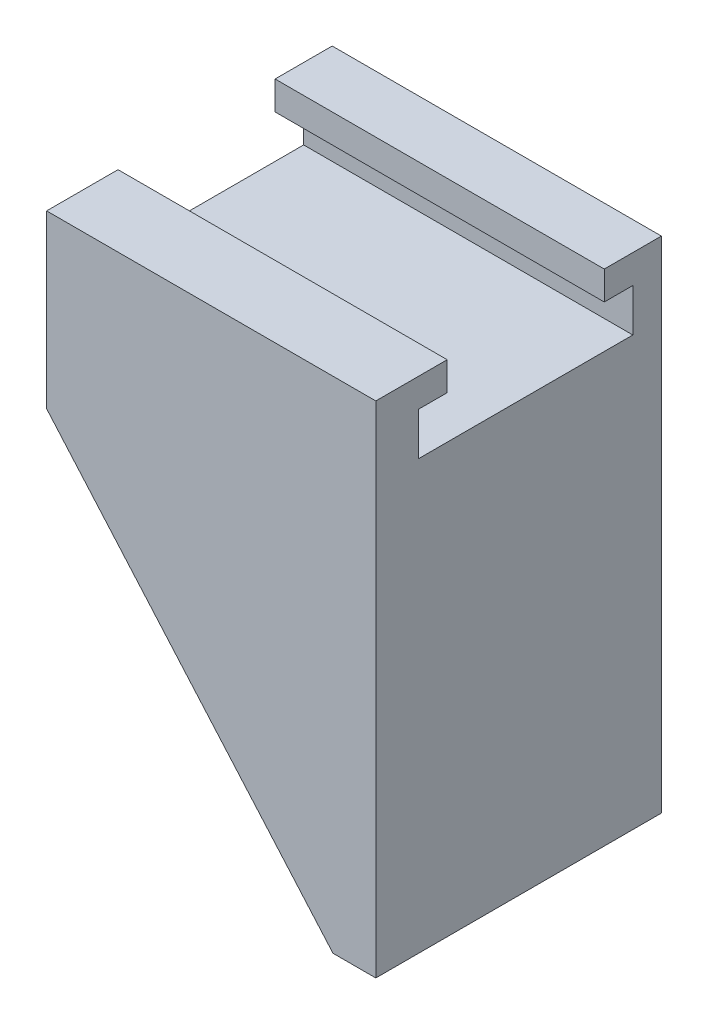
ISO-10303-21;
HEADER;
FILE_DESCRIPTION(('STEP AP214'),'2;1');
FILE_NAME('part.step','',(''),(''),'','','');
FILE_SCHEMA(('AUTOMOTIVE_DESIGN { 1 0 10303 214 1 1 1 1 }'));
ENDSEC;
DATA;
#1=APPLICATION_CONTEXT('core data for automotive mechanical design processes');
#2=APPLICATION_PROTOCOL_DEFINITION('international standard','automotive_design',2000,#1);
#3=PRODUCT_CONTEXT('',#1,'mechanical');
#4=PRODUCT('Part','Part','',(#3));
#5=PRODUCT_RELATED_PRODUCT_CATEGORY('part','',(#4));
#6=PRODUCT_DEFINITION_FORMATION('','',#4);
#7=PRODUCT_DEFINITION_CONTEXT('part definition',#1,'design');
#8=PRODUCT_DEFINITION('design','',#6,#7);
#9=PRODUCT_DEFINITION_SHAPE('','',#8);
#10=(LENGTH_UNIT() NAMED_UNIT(*) SI_UNIT(.MILLI.,.METRE.));
#11=(NAMED_UNIT(*) PLANE_ANGLE_UNIT() SI_UNIT($,.RADIAN.));
#12=(NAMED_UNIT(*) SI_UNIT($,.STERADIAN.) SOLID_ANGLE_UNIT());
#13=UNCERTAINTY_MEASURE_WITH_UNIT(LENGTH_MEASURE(1.E-05),#10,'distance_accuracy_value','');
#14=(GEOMETRIC_REPRESENTATION_CONTEXT(3) GLOBAL_UNCERTAINTY_ASSIGNED_CONTEXT((#13)) GLOBAL_UNIT_ASSIGNED_CONTEXT((#10,
#11,#12)) REPRESENTATION_CONTEXT('',''));
#15=CARTESIAN_POINT('',(0.,0.,0.));
#16=DIRECTION('',(0.,0.,1.));
#17=DIRECTION('',(1.,0.,0.));
#18=AXIS2_PLACEMENT_3D('',#15,#16,#17);
#19=CARTESIAN_POINT('',(0.,35.,-20.));
#20=DIRECTION('',(0.,1.,0.));
#21=DIRECTION('',(0.,0.,-1.));
#22=AXIS2_PLACEMENT_3D('',#19,#20,#21);
#23=PLANE('',#22);
#24=DIRECTION('',(0.,0.,1.));
#25=VECTOR('',#24,1.);
#26=CARTESIAN_POINT('',(-20.0538947368421,35.,-20.));
#27=LINE('',#26,#25);
#28=CARTESIAN_POINT('',(-20.0538947368421,35.,-5.00000000000001));
#29=VERTEX_POINT('',#28);
#30=CARTESIAN_POINT('',(-20.0538947368421,35.,0.));
#31=VERTEX_POINT('',#30);
#32=EDGE_CURVE('E49',#29,#31,#27,.T.);
#33=ORIENTED_EDGE('',*,*,#32,.T.);
#34=DIRECTION('',(1.,0.,0.));
#35=VECTOR('',#34,1.);
#36=CARTESIAN_POINT('',(0.,35.,0.));
#37=LINE('',#36,#35);
#38=CARTESIAN_POINT('',(3.,35.,0.));
#39=VERTEX_POINT('',#38);
#40=EDGE_CURVE('E132',#31,#39,#37,.T.);
#41=ORIENTED_EDGE('',*,*,#40,.T.);
#42=DIRECTION('',(0.,0.,1.));
#43=VECTOR('',#42,1.);
#44=CARTESIAN_POINT('',(3.,35.,-20.));
#45=LINE('',#44,#43);
#46=CARTESIAN_POINT('',(3.,35.,-5.00000000000001));
#47=VERTEX_POINT('',#46);
#48=EDGE_CURVE('E131',#47,#39,#45,.T.);
#49=ORIENTED_EDGE('',*,*,#48,.F.);
#50=DIRECTION('',(1.,0.,0.));
#51=VECTOR('',#50,1.);
#52=CARTESIAN_POINT('',(-20.0538947368421,35.,-5.00000000000001));
#53=LINE('',#52,#51);
#54=EDGE_CURVE('E153',#29,#47,#53,.T.);
#55=ORIENTED_EDGE('',*,*,#54,.F.);
#56=EDGE_LOOP('',(#33,#41,#49,#55));
#57=FACE_BOUND('',#56,.T.);
#58=ADVANCED_FACE('F41',(#57),#23,.T.);
#59=DIRECTION('',(1.,0.,0.));
#60=VECTOR('',#59,1.);
#61=CARTESIAN_POINT('',(-20.0538947368421,35.,-16.));
#62=LINE('',#61,#60);
#63=CARTESIAN_POINT('',(-20.0538947368421,35.,-16.));
#64=VERTEX_POINT('',#63);
#65=CARTESIAN_POINT('',(3.,35.,-16.));
#66=VERTEX_POINT('',#65);
#67=EDGE_CURVE('E256',#64,#66,#62,.T.);
#68=ORIENTED_EDGE('',*,*,#67,.T.);
#69=CARTESIAN_POINT('',(3.,35.,-20.));
#70=VERTEX_POINT('',#69);
#71=EDGE_CURVE('E143',#70,#66,#45,.T.);
#72=ORIENTED_EDGE('',*,*,#71,.F.);
#73=DIRECTION('',(1.,0.,0.));
#74=VECTOR('',#73,1.);
#75=CARTESIAN_POINT('',(0.,35.,-20.));
#76=LINE('',#75,#74);
#77=CARTESIAN_POINT('',(-20.0538947368421,35.,-20.));
#78=VERTEX_POINT('',#77);
#79=EDGE_CURVE('E126',#78,#70,#76,.T.);
#80=ORIENTED_EDGE('',*,*,#79,.F.);
#81=EDGE_CURVE('E11',#78,#64,#27,.T.);
#82=ORIENTED_EDGE('',*,*,#81,.T.);
#83=EDGE_LOOP('',(#68,#72,#80,#82));
#84=FACE_BOUND('',#83,.T.);
#85=ADVANCED_FACE('F43',(#84),#23,.T.);
#86=CARTESIAN_POINT('',(-20.0538947368421,0.,-20.));
#87=DIRECTION('',(1.,0.,0.));
#88=DIRECTION('',(0.,1.,0.));
#89=AXIS2_PLACEMENT_3D('',#86,#87,#88);
#90=PLANE('',#89);
#91=ORIENTED_EDGE('',*,*,#81,.F.);
#92=DIRECTION('',(0.,-1.,0.));
#93=VECTOR('',#92,1.);
#94=CARTESIAN_POINT('',(-20.0538947368421,0.,-20.));
#95=LINE('',#94,#93);
#96=CARTESIAN_POINT('',(-20.0538947368421,23.,-20.));
#97=VERTEX_POINT('',#96);
#98=EDGE_CURVE('E97',#78,#97,#95,.T.);
#99=ORIENTED_EDGE('',*,*,#98,.T.);
#100=DIRECTION('',(0.,0.,1.));
#101=VECTOR('',#100,1.);
#102=CARTESIAN_POINT('',(-20.0538947368421,23.,-20.));
#103=LINE('',#102,#101);
#104=CARTESIAN_POINT('',(-20.0538947368421,23.,0.));
#105=VERTEX_POINT('',#104);
#106=EDGE_CURVE('E120',#97,#105,#103,.T.);
#107=ORIENTED_EDGE('',*,*,#106,.T.);
#108=DIRECTION('',(0.,-1.,0.));
#109=VECTOR('',#108,1.);
#110=CARTESIAN_POINT('',(-20.0538947368421,0.,0.));
#111=LINE('',#110,#109);
#112=EDGE_CURVE('E135',#31,#105,#111,.T.);
#113=ORIENTED_EDGE('',*,*,#112,.F.);
#114=ORIENTED_EDGE('',*,*,#32,.F.);
#115=DIRECTION('',(0.,-1.,0.));
#116=VECTOR('',#115,1.);
#117=CARTESIAN_POINT('',(-20.0538947368421,0.,-5.00000000000001));
#118=LINE('',#117,#116);
#119=CARTESIAN_POINT('',(-20.0538947368421,33.,-5.00000000000001));
#120=VERTEX_POINT('',#119);
#121=EDGE_CURVE('E159',#29,#120,#118,.T.);
#122=ORIENTED_EDGE('',*,*,#121,.T.);
#123=DIRECTION('',(0.,0.,1.));
#124=VECTOR('',#123,1.);
#125=CARTESIAN_POINT('',(-20.0538947368421,33.,0.));
#126=LINE('',#125,#124);
#127=CARTESIAN_POINT('',(-20.0538947368421,33.,-3.00000000000001));
#128=VERTEX_POINT('',#127);
#129=EDGE_CURVE('E212',#120,#128,#126,.T.);
#130=ORIENTED_EDGE('',*,*,#129,.T.);
#131=DIRECTION('',(0.,-1.,0.));
#132=VECTOR('',#131,1.);
#133=CARTESIAN_POINT('',(-20.0538947368421,0.,-3.));
#134=LINE('',#133,#132);
#135=CARTESIAN_POINT('',(-20.0538947368421,30.,-3.00000000000001));
#136=VERTEX_POINT('',#135);
#137=EDGE_CURVE('E219',#128,#136,#134,.T.);
#138=ORIENTED_EDGE('',*,*,#137,.T.);
#139=DIRECTION('',(0.,0.,-1.));
#140=VECTOR('',#139,1.);
#141=CARTESIAN_POINT('',(-20.0538947368421,30.,0.));
#142=LINE('',#141,#140);
#143=CARTESIAN_POINT('',(-20.0538947368421,30.,-18.));
#144=VERTEX_POINT('',#143);
#145=EDGE_CURVE('E222',#136,#144,#142,.T.);
#146=ORIENTED_EDGE('',*,*,#145,.T.);
#147=DIRECTION('',(0.,-1.,0.));
#148=VECTOR('',#147,1.);
#149=CARTESIAN_POINT('',(-20.0538947368421,0.,-18.));
#150=LINE('',#149,#148);
#151=CARTESIAN_POINT('',(-20.0538947368421,33.,-18.));
#152=VERTEX_POINT('',#151);
#153=EDGE_CURVE('E233',#152,#144,#150,.T.);
#154=ORIENTED_EDGE('',*,*,#153,.F.);
#155=DIRECTION('',(0.,0.,-1.));
#156=VECTOR('',#155,1.);
#157=CARTESIAN_POINT('',(-20.0538947368421,33.,0.));
#158=LINE('',#157,#156);
#159=CARTESIAN_POINT('',(-20.0538947368421,33.,-16.));
#160=VERTEX_POINT('',#159);
#161=EDGE_CURVE('E231',#160,#152,#158,.T.);
#162=ORIENTED_EDGE('',*,*,#161,.F.);
#163=DIRECTION('',(0.,-1.,0.));
#164=VECTOR('',#163,1.);
#165=CARTESIAN_POINT('',(-20.0538947368421,0.,-16.));
#166=LINE('',#165,#164);
#167=EDGE_CURVE('E225',#64,#160,#166,.T.);
#168=ORIENTED_EDGE('',*,*,#167,.F.);
#169=EDGE_LOOP('',(#91,#99,#107,#113,#114,#122,#130,#138,#146,#154,#162,#168));
#170=FACE_BOUND('',#169,.T.);
#171=ADVANCED_FACE('F155',(#170),#90,.F.);
#172=CARTESIAN_POINT('',(0.,0.,-20.));
#173=DIRECTION('',(0.753730318125683,0.657183846072129,0.));
#174=DIRECTION('',(-0.657183846072129,0.753730318125683,0.));
#175=AXIS2_PLACEMENT_3D('',#172,#173,#174);
#176=PLANE('',#175);
#177=DIRECTION('',(0.657183846072129,-0.753730318125683,0.));
#178=VECTOR('',#177,1.);
#179=CARTESIAN_POINT('',(0.,0.,0.));
#180=LINE('',#179,#178);
#181=CARTESIAN_POINT('',(0.,0.,0.));
#182=VERTEX_POINT('',#181);
#183=EDGE_CURVE('E139',#105,#182,#180,.T.);
#184=ORIENTED_EDGE('',*,*,#183,.F.);
#185=ORIENTED_EDGE('',*,*,#106,.F.);
#186=DIRECTION('',(0.657183846072129,-0.753730318125683,0.));
#187=VECTOR('',#186,1.);
#188=CARTESIAN_POINT('',(0.,0.,-20.));
#189=LINE('',#188,#187);
#190=CARTESIAN_POINT('',(0.,0.,-20.));
#191=VERTEX_POINT('',#190);
#192=EDGE_CURVE('E109',#97,#191,#189,.T.);
#193=ORIENTED_EDGE('',*,*,#192,.T.);
#194=DIRECTION('',(0.,0.,1.));
#195=VECTOR('',#194,1.);
#196=CARTESIAN_POINT('',(0.,0.,-20.));
#197=LINE('',#196,#195);
#198=EDGE_CURVE('E115',#191,#182,#197,.T.);
#199=ORIENTED_EDGE('',*,*,#198,.T.);
#200=EDGE_LOOP('',(#184,#185,#193,#199));
#201=FACE_BOUND('',#200,.T.);
#202=ADVANCED_FACE('F123',(#201),#176,.F.);
#203=CARTESIAN_POINT('',(0.,0.,-20.));
#204=DIRECTION('',(0.,1.,0.));
#205=DIRECTION('',(0.,0.,-1.));
#206=AXIS2_PLACEMENT_3D('',#203,#204,#205);
#207=PLANE('',#206);
#208=DIRECTION('',(1.,0.,0.));
#209=VECTOR('',#208,1.);
#210=CARTESIAN_POINT('',(0.,0.,0.));
#211=LINE('',#210,#209);
#212=CARTESIAN_POINT('',(3.,0.,0.));
#213=VERTEX_POINT('',#212);
#214=EDGE_CURVE('E117',#182,#213,#211,.T.);
#215=ORIENTED_EDGE('',*,*,#214,.F.);
#216=ORIENTED_EDGE('',*,*,#198,.F.);
#217=DIRECTION('',(1.,0.,0.));
#218=VECTOR('',#217,1.);
#219=CARTESIAN_POINT('',(0.,0.,-20.));
#220=LINE('',#219,#218);
#221=CARTESIAN_POINT('',(3.,0.,-20.));
#222=VERTEX_POINT('',#221);
#223=EDGE_CURVE('E105',#191,#222,#220,.T.);
#224=ORIENTED_EDGE('',*,*,#223,.T.);
#225=DIRECTION('',(0.,0.,1.));
#226=VECTOR('',#225,1.);
#227=CARTESIAN_POINT('',(3.,0.,-20.));
#228=LINE('',#227,#226);
#229=EDGE_CURVE('E121',#222,#213,#228,.T.);
#230=ORIENTED_EDGE('',*,*,#229,.T.);
#231=EDGE_LOOP('',(#215,#216,#224,#230));
#232=FACE_BOUND('',#231,.T.);
#233=ADVANCED_FACE('F116',(#232),#207,.F.);
#234=CARTESIAN_POINT('',(3.,0.,-20.));
#235=DIRECTION('',(-1.,0.,0.));
#236=DIRECTION('',(0.,0.,-1.));
#237=AXIS2_PLACEMENT_3D('',#234,#235,#236);
#238=PLANE('',#237);
#239=DIRECTION('',(0.,0.,-1.));
#240=VECTOR('',#239,1.);
#241=CARTESIAN_POINT('',(3.,33.,0.));
#242=LINE('',#241,#240);
#243=CARTESIAN_POINT('',(3.,33.,-16.));
#244=VERTEX_POINT('',#243);
#245=CARTESIAN_POINT('',(3.,33.,-18.));
#246=VERTEX_POINT('',#245);
#247=EDGE_CURVE('E246',#244,#246,#242,.T.);
#248=ORIENTED_EDGE('',*,*,#247,.T.);
#249=DIRECTION('',(0.,-1.,0.));
#250=VECTOR('',#249,1.);
#251=CARTESIAN_POINT('',(3.,0.,-18.));
#252=LINE('',#251,#250);
#253=CARTESIAN_POINT('',(3.,30.,-18.));
#254=VERTEX_POINT('',#253);
#255=EDGE_CURVE('E249',#246,#254,#252,.T.);
#256=ORIENTED_EDGE('',*,*,#255,.T.);
#257=DIRECTION('',(0.,0.,-1.));
#258=VECTOR('',#257,1.);
#259=CARTESIAN_POINT('',(3.,30.,0.));
#260=LINE('',#259,#258);
#261=CARTESIAN_POINT('',(3.,30.,-3.00000000000001));
#262=VERTEX_POINT('',#261);
#263=EDGE_CURVE('E235',#262,#254,#260,.T.);
#264=ORIENTED_EDGE('',*,*,#263,.F.);
#265=DIRECTION('',(0.,-1.,0.));
#266=VECTOR('',#265,1.);
#267=CARTESIAN_POINT('',(3.,0.,-3.));
#268=LINE('',#267,#266);
#269=CARTESIAN_POINT('',(3.,33.,-3.00000000000001));
#270=VERTEX_POINT('',#269);
#271=EDGE_CURVE('E237',#270,#262,#268,.T.);
#272=ORIENTED_EDGE('',*,*,#271,.F.);
#273=DIRECTION('',(0.,0.,1.));
#274=VECTOR('',#273,1.);
#275=CARTESIAN_POINT('',(3.,33.,0.));
#276=LINE('',#275,#274);
#277=CARTESIAN_POINT('',(3.,33.,-5.00000000000001));
#278=VERTEX_POINT('',#277);
#279=EDGE_CURVE('E214',#278,#270,#276,.T.);
#280=ORIENTED_EDGE('',*,*,#279,.F.);
#281=DIRECTION('',(0.,-1.,0.));
#282=VECTOR('',#281,1.);
#283=CARTESIAN_POINT('',(3.,0.,-5.00000000000001));
#284=LINE('',#283,#282);
#285=EDGE_CURVE('E240',#47,#278,#284,.T.);
#286=ORIENTED_EDGE('',*,*,#285,.F.);
#287=ORIENTED_EDGE('',*,*,#48,.T.);
#288=DIRECTION('',(0.,1.,0.));
#289=VECTOR('',#288,1.);
#290=CARTESIAN_POINT('',(3.,0.,0.));
#291=LINE('',#290,#289);
#292=EDGE_CURVE('E89',#213,#39,#291,.T.);
#293=ORIENTED_EDGE('',*,*,#292,.F.);
#294=ORIENTED_EDGE('',*,*,#229,.F.);
#295=DIRECTION('',(0.,1.,0.));
#296=VECTOR('',#295,1.);
#297=CARTESIAN_POINT('',(3.,0.,-20.));
#298=LINE('',#297,#296);
#299=EDGE_CURVE('E65',#222,#70,#298,.T.);
#300=ORIENTED_EDGE('',*,*,#299,.T.);
#301=ORIENTED_EDGE('',*,*,#71,.T.);
#302=DIRECTION('',(0.,-1.,0.));
#303=VECTOR('',#302,1.);
#304=CARTESIAN_POINT('',(3.,0.,-16.));
#305=LINE('',#304,#303);
#306=EDGE_CURVE('E243',#66,#244,#305,.T.);
#307=ORIENTED_EDGE('',*,*,#306,.T.);
#308=EDGE_LOOP('',(#248,#256,#264,#272,#280,#286,#287,#293,#294,#300,#301,#307));
#309=FACE_BOUND('',#308,.T.);
#310=ADVANCED_FACE('F265',(#309),#238,.F.);
#311=CARTESIAN_POINT('',(0.,0.,-20.));
#312=DIRECTION('',(0.,0.,-1.));
#313=DIRECTION('',(1.,0.,0.));
#314=AXIS2_PLACEMENT_3D('',#311,#312,#313);
#315=PLANE('',#314);
#316=ORIENTED_EDGE('',*,*,#79,.T.);
#317=ORIENTED_EDGE('',*,*,#299,.F.);
#318=ORIENTED_EDGE('',*,*,#223,.F.);
#319=ORIENTED_EDGE('',*,*,#192,.F.);
#320=ORIENTED_EDGE('',*,*,#98,.F.);
#321=EDGE_LOOP('',(#316,#317,#318,#319,#320));
#322=FACE_BOUND('',#321,.T.);
#323=ADVANCED_FACE('F107',(#322),#315,.T.);
#324=CARTESIAN_POINT('',(0.,0.,0.));
#325=DIRECTION('',(0.,0.,-1.));
#326=DIRECTION('',(1.,0.,0.));
#327=AXIS2_PLACEMENT_3D('',#324,#325,#326);
#328=PLANE('',#327);
#329=ORIENTED_EDGE('',*,*,#40,.F.);
#330=ORIENTED_EDGE('',*,*,#112,.T.);
#331=ORIENTED_EDGE('',*,*,#183,.T.);
#332=ORIENTED_EDGE('',*,*,#214,.T.);
#333=ORIENTED_EDGE('',*,*,#292,.T.);
#334=EDGE_LOOP('',(#329,#330,#331,#332,#333));
#335=FACE_BOUND('',#334,.T.);
#336=ADVANCED_FACE('F275',(#335),#328,.F.);
#337=CARTESIAN_POINT('',(-20.0538947368421,30.,0.));
#338=DIRECTION('',(0.,1.,0.));
#339=DIRECTION('',(0.,0.,-1.));
#340=AXIS2_PLACEMENT_3D('',#337,#338,#339);
#341=PLANE('',#340);
#342=ORIENTED_EDGE('',*,*,#263,.T.);
#343=DIRECTION('',(1.,0.,0.));
#344=VECTOR('',#343,1.);
#345=CARTESIAN_POINT('',(-20.0538947368421,30.,-18.));
#346=LINE('',#345,#344);
#347=EDGE_CURVE('E136',#144,#254,#346,.T.);
#348=ORIENTED_EDGE('',*,*,#347,.F.);
#349=ORIENTED_EDGE('',*,*,#145,.F.);
#350=DIRECTION('',(1.,0.,0.));
#351=VECTOR('',#350,1.);
#352=CARTESIAN_POINT('',(-20.0538947368421,30.,-3.00000000000001));
#353=LINE('',#352,#351);
#354=EDGE_CURVE('E56',#136,#262,#353,.T.);
#355=ORIENTED_EDGE('',*,*,#354,.T.);
#356=EDGE_LOOP('',(#342,#348,#349,#355));
#357=FACE_BOUND('',#356,.T.);
#358=ADVANCED_FACE('F273',(#357),#341,.T.);
#359=CARTESIAN_POINT('',(-20.0538947368421,0.,-18.));
#360=DIRECTION('',(0.,0.,-1.));
#361=DIRECTION('',(1.,0.,0.));
#362=AXIS2_PLACEMENT_3D('',#359,#360,#361);
#363=PLANE('',#362);
#364=ORIENTED_EDGE('',*,*,#255,.F.);
#365=DIRECTION('',(1.,0.,0.));
#366=VECTOR('',#365,1.);
#367=CARTESIAN_POINT('',(-20.0538947368421,33.,-18.));
#368=LINE('',#367,#366);
#369=EDGE_CURVE('E197',#152,#246,#368,.T.);
#370=ORIENTED_EDGE('',*,*,#369,.F.);
#371=ORIENTED_EDGE('',*,*,#153,.T.);
#372=ORIENTED_EDGE('',*,*,#347,.T.);
#373=EDGE_LOOP('',(#364,#370,#371,#372));
#374=FACE_BOUND('',#373,.T.);
#375=ADVANCED_FACE('F271',(#374),#363,.F.);
#376=CARTESIAN_POINT('',(-20.0538947368421,33.,0.));
#377=DIRECTION('',(0.,1.,0.));
#378=DIRECTION('',(0.,0.,-1.));
#379=AXIS2_PLACEMENT_3D('',#376,#377,#378);
#380=PLANE('',#379);
#381=ORIENTED_EDGE('',*,*,#247,.F.);
#382=DIRECTION('',(1.,0.,0.));
#383=VECTOR('',#382,1.);
#384=CARTESIAN_POINT('',(-20.0538947368421,33.,-16.));
#385=LINE('',#384,#383);
#386=EDGE_CURVE('E254',#160,#244,#385,.T.);
#387=ORIENTED_EDGE('',*,*,#386,.F.);
#388=ORIENTED_EDGE('',*,*,#161,.T.);
#389=ORIENTED_EDGE('',*,*,#369,.T.);
#390=EDGE_LOOP('',(#381,#387,#388,#389));
#391=FACE_BOUND('',#390,.T.);
#392=ADVANCED_FACE('F267',(#391),#380,.F.);
#393=CARTESIAN_POINT('',(-20.0538947368421,0.,-16.));
#394=DIRECTION('',(0.,0.,-1.));
#395=DIRECTION('',(1.,0.,0.));
#396=AXIS2_PLACEMENT_3D('',#393,#394,#395);
#397=PLANE('',#396);
#398=ORIENTED_EDGE('',*,*,#306,.F.);
#399=ORIENTED_EDGE('',*,*,#67,.F.);
#400=ORIENTED_EDGE('',*,*,#167,.T.);
#401=ORIENTED_EDGE('',*,*,#386,.T.);
#402=EDGE_LOOP('',(#398,#399,#400,#401));
#403=FACE_BOUND('',#402,.T.);
#404=ADVANCED_FACE('F270',(#403),#397,.F.);
#405=CARTESIAN_POINT('',(-20.0538947368421,0.,-5.00000000000001));
#406=DIRECTION('',(0.,0.,-1.));
#407=DIRECTION('',(1.,0.,0.));
#408=AXIS2_PLACEMENT_3D('',#405,#406,#407);
#409=PLANE('',#408);
#410=ORIENTED_EDGE('',*,*,#285,.T.);
#411=DIRECTION('',(1.,0.,0.));
#412=VECTOR('',#411,1.);
#413=CARTESIAN_POINT('',(-20.0538947368421,33.,-5.00000000000001));
#414=LINE('',#413,#412);
#415=EDGE_CURVE('E216',#120,#278,#414,.T.);
#416=ORIENTED_EDGE('',*,*,#415,.F.);
#417=ORIENTED_EDGE('',*,*,#121,.F.);
#418=ORIENTED_EDGE('',*,*,#54,.T.);
#419=EDGE_LOOP('',(#410,#416,#417,#418));
#420=FACE_BOUND('',#419,.T.);
#421=ADVANCED_FACE('F336',(#420),#409,.T.);
#422=CARTESIAN_POINT('',(-20.0538947368421,33.,0.));
#423=DIRECTION('',(0.,-1.,0.));
#424=DIRECTION('',(0.,0.,1.));
#425=AXIS2_PLACEMENT_3D('',#422,#423,#424);
#426=PLANE('',#425);
#427=ORIENTED_EDGE('',*,*,#279,.T.);
#428=DIRECTION('',(1.,0.,0.));
#429=VECTOR('',#428,1.);
#430=CARTESIAN_POINT('',(-20.0538947368421,33.,-3.00000000000001));
#431=LINE('',#430,#429);
#432=EDGE_CURVE('E210',#128,#270,#431,.T.);
#433=ORIENTED_EDGE('',*,*,#432,.F.);
#434=ORIENTED_EDGE('',*,*,#129,.F.);
#435=ORIENTED_EDGE('',*,*,#415,.T.);
#436=EDGE_LOOP('',(#427,#433,#434,#435));
#437=FACE_BOUND('',#436,.T.);
#438=ADVANCED_FACE('F211',(#437),#426,.T.);
#439=CARTESIAN_POINT('',(-20.0538947368421,0.,-3.));
#440=DIRECTION('',(0.,0.,-1.));
#441=DIRECTION('',(0.,-1.,0.));
#442=AXIS2_PLACEMENT_3D('',#439,#440,#441);
#443=PLANE('',#442);
#444=ORIENTED_EDGE('',*,*,#271,.T.);
#445=ORIENTED_EDGE('',*,*,#354,.F.);
#446=ORIENTED_EDGE('',*,*,#137,.F.);
#447=ORIENTED_EDGE('',*,*,#432,.T.);
#448=EDGE_LOOP('',(#444,#445,#446,#447));
#449=FACE_BOUND('',#448,.T.);
#450=ADVANCED_FACE('F220',(#449),#443,.T.);
#451=CLOSED_SHELL('',(#58,#85,#171,#202,#233,#310,#323,#336,#358,#375,#392,#404,#421,#438,#450));
#452=MANIFOLD_SOLID_BREP('B2',#451);
#453=ADVANCED_BREP_SHAPE_REPRESENTATION('',(#18,#452),#14);
#454=SHAPE_DEFINITION_REPRESENTATION(#9,#453);
ENDSEC;
END-ISO-10303-21;
